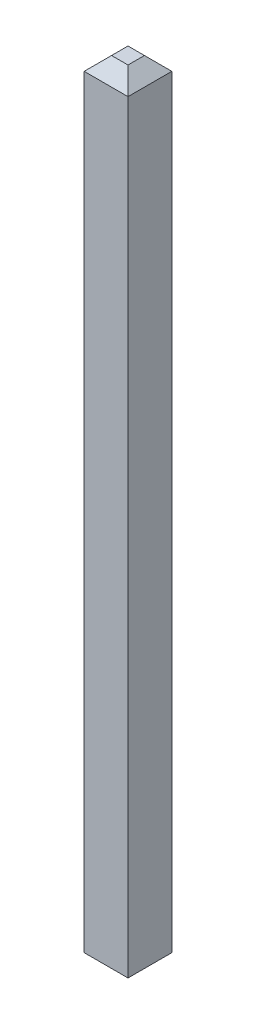
ISO-10303-21;
HEADER;
FILE_DESCRIPTION(('STEP AP214'),'2;1');
FILE_NAME('part.step','',(''),(''),'','','');
FILE_SCHEMA(('AUTOMOTIVE_DESIGN { 1 0 10303 214 1 1 1 1 }'));
ENDSEC;
DATA;
#1=APPLICATION_CONTEXT('core data for automotive mechanical design processes');
#2=APPLICATION_PROTOCOL_DEFINITION('international standard','automotive_design',2000,#1);
#3=PRODUCT_CONTEXT('',#1,'mechanical');
#4=PRODUCT('Part','Part','',(#3));
#5=PRODUCT_RELATED_PRODUCT_CATEGORY('part','',(#4));
#6=PRODUCT_DEFINITION_FORMATION('','',#4);
#7=PRODUCT_DEFINITION_CONTEXT('part definition',#1,'design');
#8=PRODUCT_DEFINITION('design','',#6,#7);
#9=PRODUCT_DEFINITION_SHAPE('','',#8);
#10=(LENGTH_UNIT() NAMED_UNIT(*) SI_UNIT(.MILLI.,.METRE.));
#11=(NAMED_UNIT(*) PLANE_ANGLE_UNIT() SI_UNIT($,.RADIAN.));
#12=(NAMED_UNIT(*) SI_UNIT($,.STERADIAN.) SOLID_ANGLE_UNIT());
#13=UNCERTAINTY_MEASURE_WITH_UNIT(LENGTH_MEASURE(1.E-05),#10,'distance_accuracy_value','');
#14=(GEOMETRIC_REPRESENTATION_CONTEXT(3) GLOBAL_UNCERTAINTY_ASSIGNED_CONTEXT((#13)) GLOBAL_UNIT_ASSIGNED_CONTEXT((#10,
#11,#12)) REPRESENTATION_CONTEXT('',''));
#15=CARTESIAN_POINT('',(0.,0.,0.));
#16=DIRECTION('',(0.,0.,1.));
#17=DIRECTION('',(1.,0.,0.));
#18=AXIS2_PLACEMENT_3D('',#15,#16,#17);
#19=CARTESIAN_POINT('',(-6.23,-4.27,-0.32));
#20=DIRECTION('',(-0.707106781186548,0.707106781186548,0.));
#21=DIRECTION('',(-0.707106781186548,-0.707106781186548,0.));
#22=AXIS2_PLACEMENT_3D('',#19,#20,#21);
#23=PLANE('',#22);
#24=DIRECTION('',(0.,0.,1.));
#25=VECTOR('',#24,1.);
#26=CARTESIAN_POINT('',(-6.02999999999999,-4.07,-0.32));
#27=LINE('',#26,#25);
#28=CARTESIAN_POINT('',(-6.03,-4.07,-0.32));
#29=VERTEX_POINT('',#28);
#30=CARTESIAN_POINT('',(-6.03,-4.07,0.32));
#31=VERTEX_POINT('',#30);
#32=EDGE_CURVE('E119',#29,#31,#27,.T.);
#33=ORIENTED_EDGE('',*,*,#32,.T.);
#34=DIRECTION('',(-0.577350269189626,-0.577350269189626,-0.577350269189626));
#35=VECTOR('',#34,1.);
#36=CARTESIAN_POINT('',(-6.03,-4.07,0.32));
#37=LINE('',#36,#35);
#38=CARTESIAN_POINT('',(-6.23,-4.27,0.12));
#39=VERTEX_POINT('',#38);
#40=EDGE_CURVE('E95',#31,#39,#37,.T.);
#41=ORIENTED_EDGE('',*,*,#40,.T.);
#42=DIRECTION('',(0.,0.,1.));
#43=VECTOR('',#42,1.);
#44=CARTESIAN_POINT('',(-6.23,-4.27,-0.32));
#45=LINE('',#44,#43);
#46=CARTESIAN_POINT('',(-6.23,-4.27,-0.12));
#47=VERTEX_POINT('',#46);
#48=EDGE_CURVE('E20',#39,#47,#45,.F.);
#49=ORIENTED_EDGE('',*,*,#48,.T.);
#50=DIRECTION('',(-0.577350269189626,-0.577350269189626,0.577350269189625));
#51=VECTOR('',#50,1.);
#52=CARTESIAN_POINT('',(-6.03,-4.07,-0.32));
#53=LINE('',#52,#51);
#54=EDGE_CURVE('E84',#29,#47,#53,.T.);
#55=ORIENTED_EDGE('',*,*,#54,.F.);
#56=EDGE_LOOP('',(#33,#41,#49,#55));
#57=FACE_BOUND('',#56,.T.);
#58=ADVANCED_FACE('F17',(#57),#23,.F.);
#59=CARTESIAN_POINT('',(-6.03,7.07,-0.32));
#60=DIRECTION('',(-0.707106781186548,-0.707106781186548,0.));
#61=DIRECTION('',(0.707106781186548,-0.707106781186548,0.));
#62=AXIS2_PLACEMENT_3D('',#59,#60,#61);
#63=PLANE('',#62);
#64=DIRECTION('',(0.,0.,1.));
#65=VECTOR('',#64,1.);
#66=CARTESIAN_POINT('',(-6.03,7.07,-0.32));
#67=LINE('',#66,#65);
#68=CARTESIAN_POINT('',(-6.03,7.07,0.32));
#69=VERTEX_POINT('',#68);
#70=CARTESIAN_POINT('',(-6.03,7.07,-0.319999999999999));
#71=VERTEX_POINT('',#70);
#72=EDGE_CURVE('E121',#69,#71,#67,.F.);
#73=ORIENTED_EDGE('',*,*,#72,.T.);
#74=DIRECTION('',(0.577350269189627,-0.577350269189627,-0.577350269189624));
#75=VECTOR('',#74,1.);
#76=CARTESIAN_POINT('',(-6.23,7.27,-0.12));
#77=LINE('',#76,#75);
#78=CARTESIAN_POINT('',(-6.23,7.27,-0.12));
#79=VERTEX_POINT('',#78);
#80=EDGE_CURVE('E78',#79,#71,#77,.T.);
#81=ORIENTED_EDGE('',*,*,#80,.F.);
#82=DIRECTION('',(0.,0.,1.));
#83=VECTOR('',#82,1.);
#84=CARTESIAN_POINT('',(-6.23,7.27,-0.32));
#85=LINE('',#84,#83);
#86=CARTESIAN_POINT('',(-6.23,7.27,0.12));
#87=VERTEX_POINT('',#86);
#88=EDGE_CURVE('E108',#79,#87,#85,.T.);
#89=ORIENTED_EDGE('',*,*,#88,.T.);
#90=DIRECTION('',(0.577350269189627,-0.577350269189627,0.577350269189624));
#91=VECTOR('',#90,1.);
#92=CARTESIAN_POINT('',(-6.23,7.27,0.119999999999999));
#93=LINE('',#92,#91);
#94=EDGE_CURVE('E116',#87,#69,#93,.T.);
#95=ORIENTED_EDGE('',*,*,#94,.T.);
#96=EDGE_LOOP('',(#73,#81,#89,#95));
#97=FACE_BOUND('',#96,.T.);
#98=ADVANCED_FACE('F214',(#97),#63,.F.);
#99=CARTESIAN_POINT('',(-6.03,-4.27,-0.32));
#100=DIRECTION('',(0.,1.,0.));
#101=DIRECTION('',(0.,0.,1.));
#102=AXIS2_PLACEMENT_3D('',#99,#100,#101);
#103=PLANE('',#102);
#104=DIRECTION('',(1.,0.,0.));
#105=VECTOR('',#104,1.);
#106=CARTESIAN_POINT('',(-6.03,-4.27,0.12));
#107=LINE('',#106,#105);
#108=CARTESIAN_POINT('',(-6.47,-4.27,0.12));
#109=VERTEX_POINT('',#108);
#110=EDGE_CURVE('E110',#39,#109,#107,.F.);
#111=ORIENTED_EDGE('',*,*,#110,.T.);
#112=DIRECTION('',(0.,0.,1.));
#113=VECTOR('',#112,1.);
#114=CARTESIAN_POINT('',(-6.47,-4.27,-0.32));
#115=LINE('',#114,#113);
#116=CARTESIAN_POINT('',(-6.47,-4.27,-0.12));
#117=VERTEX_POINT('',#116);
#118=EDGE_CURVE('E101',#109,#117,#115,.F.);
#119=ORIENTED_EDGE('',*,*,#118,.T.);
#120=DIRECTION('',(1.,0.,0.));
#121=VECTOR('',#120,1.);
#122=CARTESIAN_POINT('',(-6.35,-4.27,-0.12));
#123=LINE('',#122,#121);
#124=EDGE_CURVE('E89',#47,#117,#123,.F.);
#125=ORIENTED_EDGE('',*,*,#124,.F.);
#126=ORIENTED_EDGE('',*,*,#48,.F.);
#127=EDGE_LOOP('',(#111,#119,#125,#126));
#128=FACE_BOUND('',#127,.T.);
#129=ADVANCED_FACE('F99',(#128),#103,.F.);
#130=CARTESIAN_POINT('',(-6.35,-4.07,-0.32));
#131=DIRECTION('',(0.,-0.707106781186548,-0.707106781186548));
#132=DIRECTION('',(0.,0.707106781186548,-0.707106781186548));
#133=AXIS2_PLACEMENT_3D('',#130,#131,#132);
#134=PLANE('',#133);
#135=ORIENTED_EDGE('',*,*,#54,.T.);
#136=ORIENTED_EDGE('',*,*,#124,.T.);
#137=DIRECTION('',(-0.577350269189625,0.577350269189625,-0.577350269189627));
#138=VECTOR('',#137,1.);
#139=CARTESIAN_POINT('',(-6.47,-4.27,-0.12));
#140=LINE('',#139,#138);
#141=CARTESIAN_POINT('',(-6.67,-4.07,-0.32));
#142=VERTEX_POINT('',#141);
#143=EDGE_CURVE('E127',#117,#142,#140,.T.);
#144=ORIENTED_EDGE('',*,*,#143,.T.);
#145=DIRECTION('',(-1.,0.,0.));
#146=VECTOR('',#145,1.);
#147=CARTESIAN_POINT('',(-6.35,-4.07,-0.320000000000001));
#148=LINE('',#147,#146);
#149=EDGE_CURVE('E91',#29,#142,#148,.T.);
#150=ORIENTED_EDGE('',*,*,#149,.F.);
#151=EDGE_LOOP('',(#135,#136,#144,#150));
#152=FACE_BOUND('',#151,.T.);
#153=ADVANCED_FACE('F86',(#152),#134,.T.);
#154=CARTESIAN_POINT('',(-6.35,7.07,-0.32));
#155=DIRECTION('',(0.,0.707106781186548,-0.707106781186548));
#156=DIRECTION('',(0.,0.707106781186548,0.707106781186548));
#157=AXIS2_PLACEMENT_3D('',#154,#155,#156);
#158=PLANE('',#157);
#159=ORIENTED_EDGE('',*,*,#80,.T.);
#160=DIRECTION('',(-1.,0.,0.));
#161=VECTOR('',#160,1.);
#162=CARTESIAN_POINT('',(-6.35,7.07,-0.319999999999999));
#163=LINE('',#162,#161);
#164=CARTESIAN_POINT('',(-6.67,7.07,-0.32));
#165=VERTEX_POINT('',#164);
#166=EDGE_CURVE('E129',#165,#71,#163,.F.);
#167=ORIENTED_EDGE('',*,*,#166,.F.);
#168=DIRECTION('',(0.577350269189625,0.577350269189625,0.577350269189627));
#169=VECTOR('',#168,1.);
#170=CARTESIAN_POINT('',(-6.67,7.07,-0.32));
#171=LINE('',#170,#169);
#172=CARTESIAN_POINT('',(-6.47,7.27,-0.120000000000001));
#173=VERTEX_POINT('',#172);
#174=EDGE_CURVE('E136',#165,#173,#171,.T.);
#175=ORIENTED_EDGE('',*,*,#174,.T.);
#176=DIRECTION('',(1.,0.,0.));
#177=VECTOR('',#176,1.);
#178=CARTESIAN_POINT('',(-6.67,7.27,-0.12));
#179=LINE('',#178,#177);
#180=EDGE_CURVE('E103',#173,#79,#179,.T.);
#181=ORIENTED_EDGE('',*,*,#180,.T.);
#182=EDGE_LOOP('',(#159,#167,#175,#181));
#183=FACE_BOUND('',#182,.T.);
#184=ADVANCED_FACE('F206',(#183),#158,.T.);
#185=CARTESIAN_POINT('',(-6.67,7.27,-0.32));
#186=DIRECTION('',(0.,-1.,0.));
#187=DIRECTION('',(1.,0.,0.));
#188=AXIS2_PLACEMENT_3D('',#185,#186,#187);
#189=PLANE('',#188);
#190=ORIENTED_EDGE('',*,*,#180,.F.);
#191=DIRECTION('',(0.,0.,1.));
#192=VECTOR('',#191,1.);
#193=CARTESIAN_POINT('',(-6.47,7.27,-0.32));
#194=LINE('',#193,#192);
#195=CARTESIAN_POINT('',(-6.47,7.27,0.12));
#196=VERTEX_POINT('',#195);
#197=EDGE_CURVE('E139',#173,#196,#194,.T.);
#198=ORIENTED_EDGE('',*,*,#197,.T.);
#199=DIRECTION('',(1.,0.,0.));
#200=VECTOR('',#199,1.);
#201=CARTESIAN_POINT('',(-6.67,7.27,0.12));
#202=LINE('',#201,#200);
#203=EDGE_CURVE('E113',#196,#87,#202,.T.);
#204=ORIENTED_EDGE('',*,*,#203,.T.);
#205=ORIENTED_EDGE('',*,*,#88,.F.);
#206=EDGE_LOOP('',(#190,#198,#204,#205));
#207=FACE_BOUND('',#206,.T.);
#208=ADVANCED_FACE('F203',(#207),#189,.F.);
#209=CARTESIAN_POINT('',(-6.03,-4.27,0.12));
#210=DIRECTION('',(0.,0.707106781186548,-0.707106781186548));
#211=DIRECTION('',(0.,0.707106781186548,0.707106781186548));
#212=AXIS2_PLACEMENT_3D('',#209,#210,#211);
#213=PLANE('',#212);
#214=DIRECTION('',(-1.,0.,0.));
#215=VECTOR('',#214,1.);
#216=CARTESIAN_POINT('',(-6.35,-4.07,0.319999999999999));
#217=LINE('',#216,#215);
#218=CARTESIAN_POINT('',(-6.67,-4.07,0.32));
#219=VERTEX_POINT('',#218);
#220=EDGE_CURVE('E144',#31,#219,#217,.T.);
#221=ORIENTED_EDGE('',*,*,#220,.T.);
#222=DIRECTION('',(0.577350269189625,-0.577350269189625,-0.577350269189627));
#223=VECTOR('',#222,1.);
#224=CARTESIAN_POINT('',(-6.67,-4.07,0.32));
#225=LINE('',#224,#223);
#226=EDGE_CURVE('E123',#219,#109,#225,.T.);
#227=ORIENTED_EDGE('',*,*,#226,.T.);
#228=ORIENTED_EDGE('',*,*,#110,.F.);
#229=ORIENTED_EDGE('',*,*,#40,.F.);
#230=EDGE_LOOP('',(#221,#227,#228,#229));
#231=FACE_BOUND('',#230,.T.);
#232=ADVANCED_FACE('F176',(#231),#213,.F.);
#233=CARTESIAN_POINT('',(-6.67,7.27,0.12));
#234=DIRECTION('',(0.,-0.707106781186548,-0.707106781186548));
#235=DIRECTION('',(0.,0.707106781186548,-0.707106781186548));
#236=AXIS2_PLACEMENT_3D('',#233,#234,#235);
#237=PLANE('',#236);
#238=ORIENTED_EDGE('',*,*,#203,.F.);
#239=DIRECTION('',(-0.577350269189625,-0.577350269189625,0.577350269189627));
#240=VECTOR('',#239,1.);
#241=CARTESIAN_POINT('',(-6.47,7.27,0.12));
#242=LINE('',#241,#240);
#243=CARTESIAN_POINT('',(-6.67,7.07,0.32));
#244=VERTEX_POINT('',#243);
#245=EDGE_CURVE('E142',#196,#244,#242,.T.);
#246=ORIENTED_EDGE('',*,*,#245,.T.);
#247=DIRECTION('',(-1.,0.,0.));
#248=VECTOR('',#247,1.);
#249=CARTESIAN_POINT('',(-6.35,7.07,0.320000000000001));
#250=LINE('',#249,#248);
#251=EDGE_CURVE('E34',#244,#69,#250,.F.);
#252=ORIENTED_EDGE('',*,*,#251,.T.);
#253=ORIENTED_EDGE('',*,*,#94,.F.);
#254=EDGE_LOOP('',(#238,#246,#252,#253));
#255=FACE_BOUND('',#254,.T.);
#256=ADVANCED_FACE('F196',(#255),#237,.F.);
#257=CARTESIAN_POINT('',(-6.03,7.27,-0.32));
#258=DIRECTION('',(-1.,0.,0.));
#259=DIRECTION('',(0.,-1.,0.));
#260=AXIS2_PLACEMENT_3D('',#257,#258,#259);
#261=PLANE('',#260);
#262=ORIENTED_EDGE('',*,*,#72,.F.);
#263=DIRECTION('',(0.,1.,0.));
#264=VECTOR('',#263,1.);
#265=CARTESIAN_POINT('',(-6.03,1.5,0.32));
#266=LINE('',#265,#264);
#267=EDGE_CURVE('E148',#69,#31,#266,.F.);
#268=ORIENTED_EDGE('',*,*,#267,.T.);
#269=ORIENTED_EDGE('',*,*,#32,.F.);
#270=DIRECTION('',(0.,1.,0.));
#271=VECTOR('',#270,1.);
#272=CARTESIAN_POINT('',(-6.03,1.5,-0.32));
#273=LINE('',#272,#271);
#274=EDGE_CURVE('E132',#71,#29,#273,.F.);
#275=ORIENTED_EDGE('',*,*,#274,.F.);
#276=EDGE_LOOP('',(#262,#268,#269,#275));
#277=FACE_BOUND('',#276,.T.);
#278=ADVANCED_FACE('F193',(#277),#261,.F.);
#279=CARTESIAN_POINT('',(-6.67,-4.07,-0.32));
#280=DIRECTION('',(0.707106781186548,0.707106781186548,0.));
#281=DIRECTION('',(-0.707106781186548,0.707106781186548,0.));
#282=AXIS2_PLACEMENT_3D('',#279,#280,#281);
#283=PLANE('',#282);
#284=ORIENTED_EDGE('',*,*,#118,.F.);
#285=ORIENTED_EDGE('',*,*,#226,.F.);
#286=DIRECTION('',(0.,0.,-1.));
#287=VECTOR('',#286,1.);
#288=CARTESIAN_POINT('',(-6.67,-4.07,-0.32));
#289=LINE('',#288,#287);
#290=EDGE_CURVE('E151',#219,#142,#289,.T.);
#291=ORIENTED_EDGE('',*,*,#290,.T.);
#292=ORIENTED_EDGE('',*,*,#143,.F.);
#293=EDGE_LOOP('',(#284,#285,#291,#292));
#294=FACE_BOUND('',#293,.T.);
#295=ADVANCED_FACE('F173',(#294),#283,.F.);
#296=CARTESIAN_POINT('',(-6.35,1.5,-0.32));
#297=DIRECTION('',(0.,0.,-1.));
#298=DIRECTION('',(-1.,0.,0.));
#299=AXIS2_PLACEMENT_3D('',#296,#297,#298);
#300=PLANE('',#299);
#301=ORIENTED_EDGE('',*,*,#274,.T.);
#302=ORIENTED_EDGE('',*,*,#149,.T.);
#303=DIRECTION('',(0.,1.,0.));
#304=VECTOR('',#303,1.);
#305=CARTESIAN_POINT('',(-6.67,-4.27,-0.32));
#306=LINE('',#305,#304);
#307=EDGE_CURVE('E154',#142,#165,#306,.T.);
#308=ORIENTED_EDGE('',*,*,#307,.T.);
#309=ORIENTED_EDGE('',*,*,#166,.T.);
#310=EDGE_LOOP('',(#301,#302,#308,#309));
#311=FACE_BOUND('',#310,.T.);
#312=ADVANCED_FACE('F170',(#311),#300,.T.);
#313=CARTESIAN_POINT('',(-6.47,7.27,-0.32));
#314=DIRECTION('',(0.707106781186548,-0.707106781186548,0.));
#315=DIRECTION('',(0.707106781186548,0.707106781186548,0.));
#316=AXIS2_PLACEMENT_3D('',#313,#314,#315);
#317=PLANE('',#316);
#318=ORIENTED_EDGE('',*,*,#197,.F.);
#319=ORIENTED_EDGE('',*,*,#174,.F.);
#320=DIRECTION('',(0.,0.,-1.));
#321=VECTOR('',#320,1.);
#322=CARTESIAN_POINT('',(-6.67,7.07,-0.32));
#323=LINE('',#322,#321);
#324=EDGE_CURVE('E26',#165,#244,#323,.F.);
#325=ORIENTED_EDGE('',*,*,#324,.T.);
#326=ORIENTED_EDGE('',*,*,#245,.F.);
#327=EDGE_LOOP('',(#318,#319,#325,#326));
#328=FACE_BOUND('',#327,.T.);
#329=ADVANCED_FACE('F162',(#328),#317,.F.);
#330=CARTESIAN_POINT('',(-6.35,1.5,0.32));
#331=DIRECTION('',(0.,0.,-1.));
#332=DIRECTION('',(-1.,0.,0.));
#333=AXIS2_PLACEMENT_3D('',#330,#331,#332);
#334=PLANE('',#333);
#335=ORIENTED_EDGE('',*,*,#251,.F.);
#336=DIRECTION('',(0.,1.,0.));
#337=VECTOR('',#336,1.);
#338=CARTESIAN_POINT('',(-6.67,-4.27,0.32));
#339=LINE('',#338,#337);
#340=EDGE_CURVE('E11',#244,#219,#339,.F.);
#341=ORIENTED_EDGE('',*,*,#340,.T.);
#342=ORIENTED_EDGE('',*,*,#220,.F.);
#343=ORIENTED_EDGE('',*,*,#267,.F.);
#344=EDGE_LOOP('',(#335,#341,#342,#343));
#345=FACE_BOUND('',#344,.T.);
#346=ADVANCED_FACE('F177',(#345),#334,.F.);
#347=CARTESIAN_POINT('',(-6.67,-4.27,-0.32));
#348=DIRECTION('',(1.,0.,0.));
#349=DIRECTION('',(0.,0.,-1.));
#350=AXIS2_PLACEMENT_3D('',#347,#348,#349);
#351=PLANE('',#350);
#352=ORIENTED_EDGE('',*,*,#324,.F.);
#353=ORIENTED_EDGE('',*,*,#307,.F.);
#354=ORIENTED_EDGE('',*,*,#290,.F.);
#355=ORIENTED_EDGE('',*,*,#340,.F.);
#356=EDGE_LOOP('',(#352,#353,#354,#355));
#357=FACE_BOUND('',#356,.T.);
#358=ADVANCED_FACE('F167',(#357),#351,.F.);
#359=CLOSED_SHELL('',(#58,#98,#129,#153,#184,#208,#232,#256,#278,#295,#312,#329,#346,#358));
#360=MANIFOLD_SOLID_BREP('B1',#359);
#361=ADVANCED_BREP_SHAPE_REPRESENTATION('',(#18,#360),#14);
#362=SHAPE_DEFINITION_REPRESENTATION(#9,#361);
ENDSEC;
END-ISO-10303-21;
